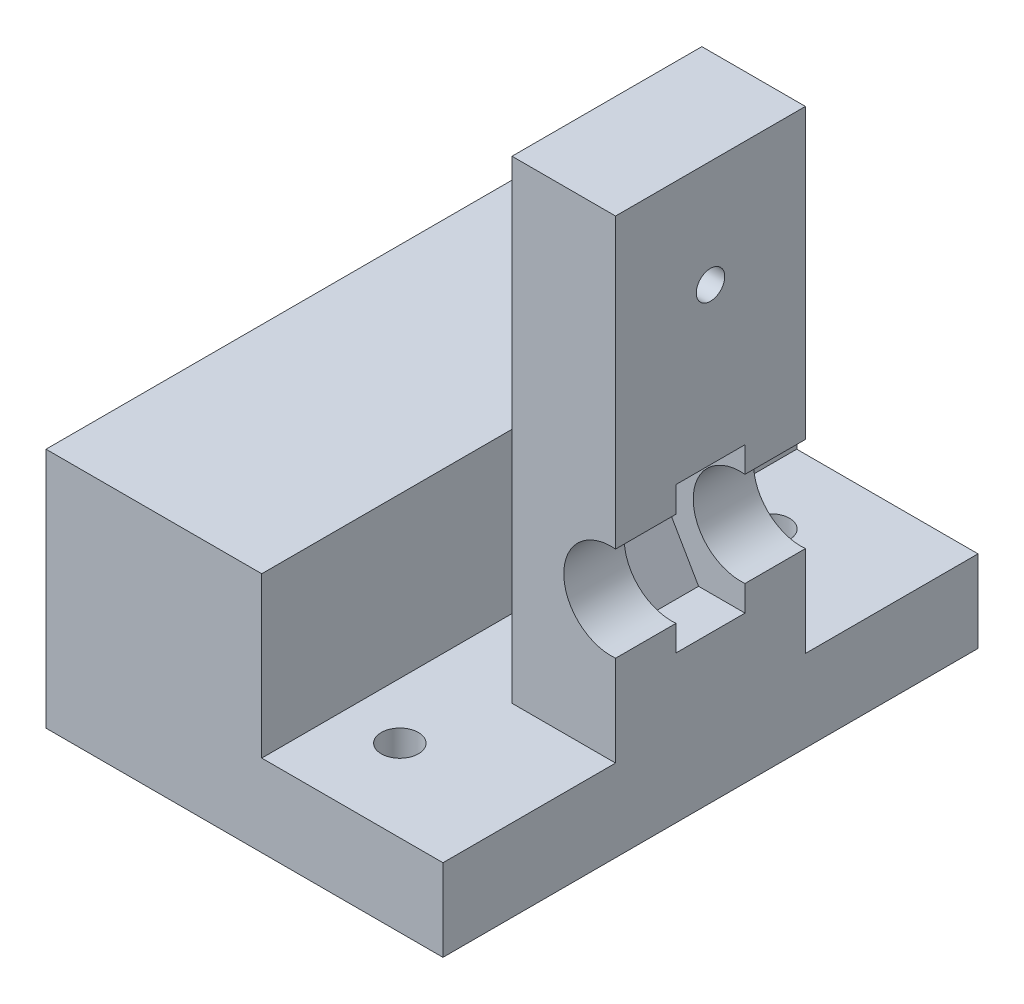
ISO-10303-21;
HEADER;
FILE_DESCRIPTION(('STEP AP214'),'2;1');
FILE_NAME('part.step','',(''),(''),'','','');
FILE_SCHEMA(('AUTOMOTIVE_DESIGN { 1 0 10303 214 1 1 1 1 }'));
ENDSEC;
DATA;
#1=APPLICATION_CONTEXT('core data for automotive mechanical design processes');
#2=APPLICATION_PROTOCOL_DEFINITION('international standard','automotive_design',2000,#1);
#3=PRODUCT_CONTEXT('',#1,'mechanical');
#4=PRODUCT('Part','Part','',(#3));
#5=PRODUCT_RELATED_PRODUCT_CATEGORY('part','',(#4));
#6=PRODUCT_DEFINITION_FORMATION('','',#4);
#7=PRODUCT_DEFINITION_CONTEXT('part definition',#1,'design');
#8=PRODUCT_DEFINITION('design','',#6,#7);
#9=PRODUCT_DEFINITION_SHAPE('','',#8);
#10=(LENGTH_UNIT() NAMED_UNIT(*) SI_UNIT(.MILLI.,.METRE.));
#11=(NAMED_UNIT(*) PLANE_ANGLE_UNIT() SI_UNIT($,.RADIAN.));
#12=(NAMED_UNIT(*) SI_UNIT($,.STERADIAN.) SOLID_ANGLE_UNIT());
#13=UNCERTAINTY_MEASURE_WITH_UNIT(LENGTH_MEASURE(1.E-05),#10,'distance_accuracy_value','');
#14=(GEOMETRIC_REPRESENTATION_CONTEXT(3) GLOBAL_UNCERTAINTY_ASSIGNED_CONTEXT((#13)) GLOBAL_UNIT_ASSIGNED_CONTEXT((#10,
#11,#12)) REPRESENTATION_CONTEXT('',''));
#15=CARTESIAN_POINT('',(0.,0.,0.));
#16=DIRECTION('',(0.,0.,1.));
#17=DIRECTION('',(1.,0.,0.));
#18=AXIS2_PLACEMENT_3D('',#15,#16,#17);
#19=CARTESIAN_POINT('',(0.,-50.2793146590531,0.));
#20=DIRECTION('',(0.,1.,0.));
#21=DIRECTION('',(0.,0.,1.));
#22=AXIS2_PLACEMENT_3D('',#19,#20,#21);
#23=PLANE('',#22);
#24=CARTESIAN_POINT('',(-14.3674698795181,-50.2793146590531,-17.5));
#25=DIRECTION('',(0.,1.,0.));
#26=DIRECTION('',(0.,0.,1.));
#27=AXIS2_PLACEMENT_3D('',#24,#25,#26);
#28=CIRCLE('',#27,2.15);
#29=CARTESIAN_POINT('',(-14.3674698795181,-50.2793146590531,-15.35));
#30=VERTEX_POINT('',#29);
#31=EDGE_CURVE('E232',#30,#30,#28,.T.);
#32=ORIENTED_EDGE('',*,*,#31,.F.);
#33=EDGE_LOOP('',(#32));
#34=FACE_BOUND('',#33,.T.);
#35=CARTESIAN_POINT('',(-14.3674698795181,-50.2793146590531,25.5));
#36=DIRECTION('',(0.,1.,0.));
#37=DIRECTION('',(0.,0.,1.));
#38=AXIS2_PLACEMENT_3D('',#35,#36,#37);
#39=CIRCLE('',#38,2.15);
#40=CARTESIAN_POINT('',(-14.3674698795181,-50.2793146590531,27.65));
#41=VERTEX_POINT('',#40);
#42=EDGE_CURVE('E219',#41,#41,#39,.T.);
#43=ORIENTED_EDGE('',*,*,#42,.F.);
#44=EDGE_LOOP('',(#43));
#45=FACE_BOUND('',#44,.T.);
#46=DIRECTION('',(1.,0.,0.));
#47=VECTOR('',#46,1.);
#48=CARTESIAN_POINT('',(0.132530120481926,-50.2793146590531,-27.));
#49=LINE('',#48,#47);
#50=CARTESIAN_POINT('',(-20.8674698795181,-50.2793146590531,-27.));
#51=VERTEX_POINT('',#50);
#52=CARTESIAN_POINT('',(0.132530120481926,-50.2793146590531,-27.));
#53=VERTEX_POINT('',#52);
#54=EDGE_CURVE('E246',#51,#53,#49,.T.);
#55=ORIENTED_EDGE('',*,*,#54,.F.);
#56=DIRECTION('',(0.,0.,-1.));
#57=VECTOR('',#56,1.);
#58=CARTESIAN_POINT('',(-20.8674698795181,-50.2793146590531,-27.));
#59=LINE('',#58,#57);
#60=CARTESIAN_POINT('',(-20.8674698795181,-50.2793146590531,35.));
#61=VERTEX_POINT('',#60);
#62=EDGE_CURVE('E207',#61,#51,#59,.T.);
#63=ORIENTED_EDGE('',*,*,#62,.F.);
#64=DIRECTION('',(-1.,0.,0.));
#65=VECTOR('',#64,1.);
#66=CARTESIAN_POINT('',(0.132530120481924,-50.2793146590531,35.));
#67=LINE('',#66,#65);
#68=CARTESIAN_POINT('',(0.132530120481924,-50.2793146590531,35.));
#69=VERTEX_POINT('',#68);
#70=EDGE_CURVE('E243',#69,#61,#67,.T.);
#71=ORIENTED_EDGE('',*,*,#70,.F.);
#72=DIRECTION('',(0.,0.,1.));
#73=VECTOR('',#72,1.);
#74=CARTESIAN_POINT('',(0.132530120481924,-50.2793146590531,15.));
#75=LINE('',#74,#73);
#76=CARTESIAN_POINT('',(0.132530120481924,-50.2793146590531,15.));
#77=VERTEX_POINT('',#76);
#78=EDGE_CURVE('E244',#77,#69,#75,.T.);
#79=ORIENTED_EDGE('',*,*,#78,.F.);
#80=DIRECTION('',(-1.,0.,0.));
#81=VECTOR('',#80,1.);
#82=CARTESIAN_POINT('',(0.,-50.2793146590531,15.));
#83=LINE('',#82,#81);
#84=CARTESIAN_POINT('',(-11.8674698795181,-50.2793146590531,15.));
#85=VERTEX_POINT('',#84);
#86=EDGE_CURVE('E264',#77,#85,#83,.T.);
#87=ORIENTED_EDGE('',*,*,#86,.T.);
#88=DIRECTION('',(0.,0.,1.));
#89=VECTOR('',#88,1.);
#90=CARTESIAN_POINT('',(-11.8674698795181,-50.2793146590531,8.));
#91=LINE('',#90,#89);
#92=CARTESIAN_POINT('',(-11.8674698795181,-50.2793146590531,-7.));
#93=VERTEX_POINT('',#92);
#94=EDGE_CURVE('E256',#93,#85,#91,.T.);
#95=ORIENTED_EDGE('',*,*,#94,.F.);
#96=DIRECTION('',(1.,0.,0.));
#97=VECTOR('',#96,1.);
#98=CARTESIAN_POINT('',(0.,-50.2793146590531,-7.));
#99=LINE('',#98,#97);
#100=CARTESIAN_POINT('',(0.132530120481924,-50.2793146590531,-7.));
#101=VERTEX_POINT('',#100);
#102=EDGE_CURVE('E262',#93,#101,#99,.T.);
#103=ORIENTED_EDGE('',*,*,#102,.T.);
#104=EDGE_CURVE('E240',#53,#101,#75,.T.);
#105=ORIENTED_EDGE('',*,*,#104,.F.);
#106=EDGE_LOOP('',(#55,#63,#71,#79,#87,#95,#103,#105));
#107=FACE_BOUND('',#106,.T.);
#108=ADVANCED_FACE('F49',(#34,#45,#107),#23,.T.);
#109=CARTESIAN_POINT('',(-11.8674698795181,-59.7793146590531,8.));
#110=DIRECTION('',(0.,1.,0.));
#111=DIRECTION('',(0.,0.,1.));
#112=AXIS2_PLACEMENT_3D('',#109,#110,#111);
#113=PLANE('',#112);
#114=CARTESIAN_POINT('',(-34.0674698795181,-59.7793146590531,23.2));
#115=DIRECTION('',(0.,-1.,0.));
#116=DIRECTION('',(0.,0.,-1.));
#117=AXIS2_PLACEMENT_3D('',#114,#115,#116);
#118=CIRCLE('',#117,4.75);
#119=CARTESIAN_POINT('',(-34.0674698795181,-59.7793146590531,18.45));
#120=VERTEX_POINT('',#119);
#121=EDGE_CURVE('E220',#120,#120,#118,.T.);
#122=ORIENTED_EDGE('',*,*,#121,.F.);
#123=EDGE_LOOP('',(#122));
#124=FACE_BOUND('',#123,.T.);
#125=CARTESIAN_POINT('',(-34.0674698795181,-59.7793146590531,-15.2));
#126=DIRECTION('',(0.,-1.,0.));
#127=DIRECTION('',(0.,0.,-1.));
#128=AXIS2_PLACEMENT_3D('',#125,#126,#127);
#129=CIRCLE('',#128,4.75);
#130=CARTESIAN_POINT('',(-34.0674698795181,-59.7793146590531,-19.95));
#131=VERTEX_POINT('',#130);
#132=EDGE_CURVE('E215',#131,#131,#129,.T.);
#133=ORIENTED_EDGE('',*,*,#132,.F.);
#134=EDGE_LOOP('',(#133));
#135=FACE_BOUND('',#134,.T.);
#136=CARTESIAN_POINT('',(-14.3674698795181,-59.7793146590531,-17.5));
#137=DIRECTION('',(0.,1.,0.));
#138=DIRECTION('',(0.,0.,1.));
#139=AXIS2_PLACEMENT_3D('',#136,#137,#138);
#140=CIRCLE('',#139,2.15);
#141=CARTESIAN_POINT('',(-14.3674698795181,-59.7793146590531,-15.35));
#142=VERTEX_POINT('',#141);
#143=EDGE_CURVE('E228',#142,#142,#140,.T.);
#144=ORIENTED_EDGE('',*,*,#143,.T.);
#145=EDGE_LOOP('',(#144));
#146=FACE_BOUND('',#145,.T.);
#147=CARTESIAN_POINT('',(-14.3674698795181,-59.7793146590531,25.5));
#148=DIRECTION('',(0.,1.,0.));
#149=DIRECTION('',(0.,0.,1.));
#150=AXIS2_PLACEMENT_3D('',#147,#148,#149);
#151=CIRCLE('',#150,2.15);
#152=CARTESIAN_POINT('',(-14.3674698795181,-59.7793146590531,27.65));
#153=VERTEX_POINT('',#152);
#154=EDGE_CURVE('E235',#153,#153,#151,.T.);
#155=ORIENTED_EDGE('',*,*,#154,.T.);
#156=EDGE_LOOP('',(#155));
#157=FACE_BOUND('',#156,.T.);
#158=DIRECTION('',(0.,0.,-1.));
#159=VECTOR('',#158,1.);
#160=CARTESIAN_POINT('',(0.132530120481924,-59.7793146590531,15.));
#161=LINE('',#160,#159);
#162=CARTESIAN_POINT('',(0.132530120481924,-59.7793146590531,35.));
#163=VERTEX_POINT('',#162);
#164=CARTESIAN_POINT('',(0.132530120481926,-59.7793146590531,-27.));
#165=VERTEX_POINT('',#164);
#166=EDGE_CURVE('E269',#163,#165,#161,.T.);
#167=ORIENTED_EDGE('',*,*,#166,.F.);
#168=DIRECTION('',(-1.,0.,0.));
#169=VECTOR('',#168,1.);
#170=CARTESIAN_POINT('',(0.132530120481924,-59.7793146590531,35.));
#171=LINE('',#170,#169);
#172=CARTESIAN_POINT('',(-45.8674698795181,-59.7793146590531,35.));
#173=VERTEX_POINT('',#172);
#174=EDGE_CURVE('E231',#163,#173,#171,.T.);
#175=ORIENTED_EDGE('',*,*,#174,.T.);
#176=DIRECTION('',(0.,0.,-1.));
#177=VECTOR('',#176,1.);
#178=CARTESIAN_POINT('',(-45.8674698795181,-59.7793146590531,-27.));
#179=LINE('',#178,#177);
#180=CARTESIAN_POINT('',(-45.8674698795181,-59.7793146590531,-27.));
#181=VERTEX_POINT('',#180);
#182=EDGE_CURVE('E188',#173,#181,#179,.T.);
#183=ORIENTED_EDGE('',*,*,#182,.T.);
#184=DIRECTION('',(1.,0.,0.));
#185=VECTOR('',#184,1.);
#186=CARTESIAN_POINT('',(0.132530120481926,-59.7793146590531,-27.));
#187=LINE('',#186,#185);
#188=EDGE_CURVE('E250',#181,#165,#187,.T.);
#189=ORIENTED_EDGE('',*,*,#188,.T.);
#190=EDGE_LOOP('',(#167,#175,#183,#189));
#191=FACE_BOUND('',#190,.T.);
#192=ADVANCED_FACE('F417',(#124,#135,#146,#157,#191),#113,.F.);
#193=CARTESIAN_POINT('',(-11.8674698795181,4.62068534094692,8.));
#194=DIRECTION('',(0.,-1.,0.));
#195=DIRECTION('',(1.,0.,0.));
#196=AXIS2_PLACEMENT_3D('',#193,#194,#195);
#197=PLANE('',#196);
#198=DIRECTION('',(0.,0.,1.));
#199=VECTOR('',#198,1.);
#200=CARTESIAN_POINT('',(0.132530120481913,4.62068534094692,15.));
#201=LINE('',#200,#199);
#202=CARTESIAN_POINT('',(0.132530120481913,4.62068534094692,-7.));
#203=VERTEX_POINT('',#202);
#204=CARTESIAN_POINT('',(0.132530120481913,4.62068534094692,15.));
#205=VERTEX_POINT('',#204);
#206=EDGE_CURVE('E274',#203,#205,#201,.T.);
#207=ORIENTED_EDGE('',*,*,#206,.F.);
#208=DIRECTION('',(1.,0.,0.));
#209=VECTOR('',#208,1.);
#210=CARTESIAN_POINT('',(11.1325301204819,4.62068534094692,-7.));
#211=LINE('',#210,#209);
#212=CARTESIAN_POINT('',(-11.8674698795181,4.62068534094692,-7.));
#213=VERTEX_POINT('',#212);
#214=EDGE_CURVE('E309',#213,#203,#211,.T.);
#215=ORIENTED_EDGE('',*,*,#214,.F.);
#216=DIRECTION('',(0.,0.,-1.));
#217=VECTOR('',#216,1.);
#218=CARTESIAN_POINT('',(-11.8674698795181,4.62068534094692,8.));
#219=LINE('',#218,#217);
#220=CARTESIAN_POINT('',(-11.8674698795181,4.62068534094692,15.));
#221=VERTEX_POINT('',#220);
#222=EDGE_CURVE('E13',#221,#213,#219,.T.);
#223=ORIENTED_EDGE('',*,*,#222,.F.);
#224=DIRECTION('',(-1.,0.,0.));
#225=VECTOR('',#224,1.);
#226=CARTESIAN_POINT('',(-11.8674698795181,4.62068534094692,15.));
#227=LINE('',#226,#225);
#228=EDGE_CURVE('E321',#205,#221,#227,.T.);
#229=ORIENTED_EDGE('',*,*,#228,.F.);
#230=EDGE_LOOP('',(#207,#215,#223,#229));
#231=FACE_BOUND('',#230,.T.);
#232=ADVANCED_FACE('F379',(#231),#197,.F.);
#233=CARTESIAN_POINT('',(4.51113989513426,-25.8293146590531,8.));
#234=DIRECTION('',(0.,-1.,0.));
#235=DIRECTION('',(0.,0.,-1.));
#236=AXIS2_PLACEMENT_3D('',#233,#234,#235);
#237=PLANE('',#236);
#238=DIRECTION('',(-1.,0.,0.));
#239=VECTOR('',#238,1.);
#240=CARTESIAN_POINT('',(4.51113989513426,-25.8293146590531,0.));
#241=LINE('',#240,#239);
#242=CARTESIAN_POINT('',(0.132530120481917,-25.8293146590531,0.));
#243=VERTEX_POINT('',#242);
#244=CARTESIAN_POINT('',(-5.24607965417042,-25.8293146590531,0.));
#245=VERTEX_POINT('',#244);
#246=EDGE_CURVE('E323',#243,#245,#241,.T.);
#247=ORIENTED_EDGE('',*,*,#246,.F.);
#248=DIRECTION('',(0.,0.,1.));
#249=VECTOR('',#248,1.);
#250=CARTESIAN_POINT('',(0.132530120481917,-25.8293146590531,8.));
#251=LINE('',#250,#249);
#252=CARTESIAN_POINT('',(0.132530120481917,-25.8293146590531,8.));
#253=VERTEX_POINT('',#252);
#254=EDGE_CURVE('E292',#243,#253,#251,.T.);
#255=ORIENTED_EDGE('',*,*,#254,.T.);
#256=DIRECTION('',(-1.,0.,0.));
#257=VECTOR('',#256,1.);
#258=CARTESIAN_POINT('',(4.51113989513426,-25.8293146590531,8.));
#259=LINE('',#258,#257);
#260=CARTESIAN_POINT('',(-5.24607965417042,-25.8293146590531,8.));
#261=VERTEX_POINT('',#260);
#262=EDGE_CURVE('E324',#253,#261,#259,.T.);
#263=ORIENTED_EDGE('',*,*,#262,.T.);
#264=DIRECTION('',(0.,0.,-1.));
#265=VECTOR('',#264,1.);
#266=CARTESIAN_POINT('',(-5.24607965417042,-25.8293146590531,8.));
#267=LINE('',#266,#265);
#268=EDGE_CURVE('E58',#261,#245,#267,.T.);
#269=ORIENTED_EDGE('',*,*,#268,.T.);
#270=EDGE_LOOP('',(#247,#255,#263,#269));
#271=FACE_BOUND('',#270,.T.);
#272=ADVANCED_FACE('F354',(#271),#237,.T.);
#273=CARTESIAN_POINT('',(-5.24607965417041,-42.7293146590531,8.));
#274=DIRECTION('',(0.,1.,0.));
#275=DIRECTION('',(0.,0.,1.));
#276=AXIS2_PLACEMENT_3D('',#273,#274,#275);
#277=PLANE('',#276);
#278=DIRECTION('',(1.,0.,0.));
#279=VECTOR('',#278,1.);
#280=CARTESIAN_POINT('',(-5.24607965417041,-42.7293146590531,8.));
#281=LINE('',#280,#279);
#282=CARTESIAN_POINT('',(-5.24607965417041,-42.7293146590531,8.));
#283=VERTEX_POINT('',#282);
#284=CARTESIAN_POINT('',(0.13253012048192,-42.7293146590531,8.));
#285=VERTEX_POINT('',#284);
#286=EDGE_CURVE('E333',#283,#285,#281,.T.);
#287=ORIENTED_EDGE('',*,*,#286,.T.);
#288=DIRECTION('',(0.,0.,-1.));
#289=VECTOR('',#288,1.);
#290=CARTESIAN_POINT('',(0.13253012048192,-42.7293146590531,8.));
#291=LINE('',#290,#289);
#292=CARTESIAN_POINT('',(0.13253012048192,-42.7293146590531,0.));
#293=VERTEX_POINT('',#292);
#294=EDGE_CURVE('E281',#285,#293,#291,.T.);
#295=ORIENTED_EDGE('',*,*,#294,.T.);
#296=DIRECTION('',(1.,0.,0.));
#297=VECTOR('',#296,1.);
#298=CARTESIAN_POINT('',(-5.24607965417041,-42.7293146590531,0.));
#299=LINE('',#298,#297);
#300=CARTESIAN_POINT('',(-5.24607965417041,-42.7293146590531,0.));
#301=VERTEX_POINT('',#300);
#302=EDGE_CURVE('E327',#301,#293,#299,.T.);
#303=ORIENTED_EDGE('',*,*,#302,.F.);
#304=DIRECTION('',(0.,0.,-1.));
#305=VECTOR('',#304,1.);
#306=CARTESIAN_POINT('',(-5.24607965417041,-42.7293146590531,8.));
#307=LINE('',#306,#305);
#308=EDGE_CURVE('E336',#283,#301,#307,.T.);
#309=ORIENTED_EDGE('',*,*,#308,.F.);
#310=EDGE_LOOP('',(#287,#295,#303,#309));
#311=FACE_BOUND('',#310,.T.);
#312=ADVANCED_FACE('F401',(#311),#277,.T.);
#313=CARTESIAN_POINT('',(0.,0.,15.));
#314=DIRECTION('',(0.,0.,1.));
#315=DIRECTION('',(1.,0.,0.));
#316=AXIS2_PLACEMENT_3D('',#313,#314,#315);
#317=PLANE('',#316);
#318=ORIENTED_EDGE('',*,*,#86,.F.);
#319=DIRECTION('',(0.,-1.,0.));
#320=VECTOR('',#319,1.);
#321=CARTESIAN_POINT('',(0.132530120481913,4.62068534094692,15.));
#322=LINE('',#321,#320);
#323=CARTESIAN_POINT('',(0.13253012048192,-39.7565402341047,15.));
#324=VERTEX_POINT('',#323);
#325=EDGE_CURVE('E266',#324,#77,#322,.T.);
#326=ORIENTED_EDGE('',*,*,#325,.F.);
#327=CARTESIAN_POINT('',(-0.367469879518079,-34.2793146590531,15.));
#328=DIRECTION('',(0.,0.,1.));
#329=DIRECTION('',(1.,0.,0.));
#330=AXIS2_PLACEMENT_3D('',#327,#328,#329);
#331=CIRCLE('',#330,5.5);
#332=CARTESIAN_POINT('',(0.132530120481919,-28.8020890840014,15.));
#333=VERTEX_POINT('',#332);
#334=EDGE_CURVE('E313',#333,#324,#331,.T.);
#335=ORIENTED_EDGE('',*,*,#334,.F.);
#336=EDGE_CURVE('E267',#205,#333,#322,.T.);
#337=ORIENTED_EDGE('',*,*,#336,.F.);
#338=ORIENTED_EDGE('',*,*,#228,.T.);
#339=DIRECTION('',(0.,-1.,0.));
#340=VECTOR('',#339,1.);
#341=CARTESIAN_POINT('',(-11.8674698795181,4.62068534094692,15.));
#342=LINE('',#341,#340);
#343=EDGE_CURVE('E316',#221,#85,#342,.T.);
#344=ORIENTED_EDGE('',*,*,#343,.T.);
#345=EDGE_LOOP('',(#318,#326,#335,#337,#338,#344));
#346=FACE_BOUND('',#345,.T.);
#347=ADVANCED_FACE('F386',(#346),#317,.T.);
#348=CARTESIAN_POINT('',(0.,0.,8.));
#349=DIRECTION('',(0.,0.,1.));
#350=DIRECTION('',(1.,0.,0.));
#351=AXIS2_PLACEMENT_3D('',#348,#349,#350);
#352=PLANE('',#351);
#353=DIRECTION('',(0.,1.,0.));
#354=VECTOR('',#353,1.);
#355=CARTESIAN_POINT('',(0.132530120481913,0.,8.));
#356=LINE('',#355,#354);
#357=CARTESIAN_POINT('',(0.13253012048192,-39.7565402341047,8.));
#358=VERTEX_POINT('',#357);
#359=EDGE_CURVE('E284',#285,#358,#356,.T.);
#360=ORIENTED_EDGE('',*,*,#359,.F.);
#361=ORIENTED_EDGE('',*,*,#286,.F.);
#362=DIRECTION('',(0.5,-0.866025403784438,0.));
#363=VECTOR('',#362,1.);
#364=CARTESIAN_POINT('',(-10.1246894288228,-34.2793146590531,8.));
#365=LINE('',#364,#363);
#366=CARTESIAN_POINT('',(-10.1246894288228,-34.2793146590531,8.));
#367=VERTEX_POINT('',#366);
#368=EDGE_CURVE('E330',#367,#283,#365,.T.);
#369=ORIENTED_EDGE('',*,*,#368,.F.);
#370=DIRECTION('',(-0.5,-0.866025403784439,0.));
#371=VECTOR('',#370,1.);
#372=CARTESIAN_POINT('',(-5.24607965417042,-25.8293146590531,8.));
#373=LINE('',#372,#371);
#374=EDGE_CURVE('E326',#261,#367,#373,.T.);
#375=ORIENTED_EDGE('',*,*,#374,.F.);
#376=ORIENTED_EDGE('',*,*,#262,.F.);
#377=CARTESIAN_POINT('',(0.132530120481918,-28.8020890840014,8.));
#378=VERTEX_POINT('',#377);
#379=EDGE_CURVE('E287',#378,#253,#356,.T.);
#380=ORIENTED_EDGE('',*,*,#379,.F.);
#381=CARTESIAN_POINT('',(-0.367469879518079,-34.2793146590531,8.));
#382=DIRECTION('',(0.,0.,1.));
#383=DIRECTION('',(1.,0.,0.));
#384=AXIS2_PLACEMENT_3D('',#381,#382,#383);
#385=CIRCLE('',#384,5.5);
#386=EDGE_CURVE('E312',#378,#358,#385,.T.);
#387=ORIENTED_EDGE('',*,*,#386,.T.);
#388=EDGE_LOOP('',(#360,#361,#369,#375,#376,#380,#387));
#389=FACE_BOUND('',#388,.T.);
#390=ADVANCED_FACE('F395',(#389),#352,.F.);
#391=CARTESIAN_POINT('',(-0.367469879518079,-34.2793146590531,15.));
#392=DIRECTION('',(0.,0.,-1.));
#393=DIRECTION('',(-1.,0.,0.));
#394=AXIS2_PLACEMENT_3D('',#391,#392,#393);
#395=CYLINDRICAL_SURFACE('',#394,5.5);
#396=ORIENTED_EDGE('',*,*,#334,.T.);
#397=DIRECTION('',(0.,0.,-1.));
#398=VECTOR('',#397,1.);
#399=CARTESIAN_POINT('',(0.13253012048192,-39.7565402341047,15.));
#400=LINE('',#399,#398);
#401=EDGE_CURVE('E286',#324,#358,#400,.T.);
#402=ORIENTED_EDGE('',*,*,#401,.T.);
#403=ORIENTED_EDGE('',*,*,#386,.F.);
#404=DIRECTION('',(0.,0.,-1.));
#405=VECTOR('',#404,1.);
#406=CARTESIAN_POINT('',(0.132530120481918,-28.8020890840014,15.));
#407=LINE('',#406,#405);
#408=EDGE_CURVE('E295',#378,#333,#407,.F.);
#409=ORIENTED_EDGE('',*,*,#408,.T.);
#410=EDGE_LOOP('',(#396,#402,#403,#409));
#411=FACE_BOUND('',#410,.T.);
#412=ADVANCED_FACE('F390',(#411),#395,.F.);
#413=CARTESIAN_POINT('',(0.,0.,0.));
#414=DIRECTION('',(0.,0.,-1.));
#415=DIRECTION('',(-1.,0.,0.));
#416=AXIS2_PLACEMENT_3D('',#413,#414,#415);
#417=PLANE('',#416);
#418=DIRECTION('',(0.,-1.,0.));
#419=VECTOR('',#418,1.);
#420=CARTESIAN_POINT('',(0.132530120481913,0.,0.));
#421=LINE('',#420,#419);
#422=CARTESIAN_POINT('',(0.132530120481918,-28.8020890840014,0.));
#423=VERTEX_POINT('',#422);
#424=EDGE_CURVE('E73',#243,#423,#421,.T.);
#425=ORIENTED_EDGE('',*,*,#424,.F.);
#426=ORIENTED_EDGE('',*,*,#246,.T.);
#427=DIRECTION('',(-0.5,-0.866025403784439,0.));
#428=VECTOR('',#427,1.);
#429=CARTESIAN_POINT('',(-5.24607965417042,-25.8293146590531,0.));
#430=LINE('',#429,#428);
#431=CARTESIAN_POINT('',(-10.1246894288228,-34.2793146590531,0.));
#432=VERTEX_POINT('',#431);
#433=EDGE_CURVE('E338',#245,#432,#430,.T.);
#434=ORIENTED_EDGE('',*,*,#433,.T.);
#435=DIRECTION('',(0.5,-0.866025403784438,0.));
#436=VECTOR('',#435,1.);
#437=CARTESIAN_POINT('',(-10.1246894288228,-34.2793146590531,0.));
#438=LINE('',#437,#436);
#439=EDGE_CURVE('E341',#432,#301,#438,.T.);
#440=ORIENTED_EDGE('',*,*,#439,.T.);
#441=ORIENTED_EDGE('',*,*,#302,.T.);
#442=CARTESIAN_POINT('',(0.13253012048192,-39.7565402341047,0.));
#443=VERTEX_POINT('',#442);
#444=EDGE_CURVE('E279',#443,#293,#421,.T.);
#445=ORIENTED_EDGE('',*,*,#444,.F.);
#446=CARTESIAN_POINT('',(-0.367469879518079,-34.2793146590531,0.));
#447=DIRECTION('',(0.,0.,-1.));
#448=DIRECTION('',(-1.,0.,0.));
#449=AXIS2_PLACEMENT_3D('',#446,#447,#448);
#450=CIRCLE('',#449,5.5);
#451=EDGE_CURVE('E301',#443,#423,#450,.T.);
#452=ORIENTED_EDGE('',*,*,#451,.T.);
#453=EDGE_LOOP('',(#425,#426,#434,#440,#441,#445,#452));
#454=FACE_BOUND('',#453,.T.);
#455=ADVANCED_FACE('F362',(#454),#417,.F.);
#456=CARTESIAN_POINT('',(0.,0.,-7.));
#457=DIRECTION('',(0.,0.,-1.));
#458=DIRECTION('',(-1.,0.,0.));
#459=AXIS2_PLACEMENT_3D('',#456,#457,#458);
#460=PLANE('',#459);
#461=ORIENTED_EDGE('',*,*,#102,.F.);
#462=DIRECTION('',(0.,1.,0.));
#463=VECTOR('',#462,1.);
#464=CARTESIAN_POINT('',(-11.8674698795181,4.62068534094692,-7.));
#465=LINE('',#464,#463);
#466=EDGE_CURVE('E305',#93,#213,#465,.T.);
#467=ORIENTED_EDGE('',*,*,#466,.T.);
#468=ORIENTED_EDGE('',*,*,#214,.T.);
#469=DIRECTION('',(0.,1.,0.));
#470=VECTOR('',#469,1.);
#471=CARTESIAN_POINT('',(0.132530120481913,4.62068534094692,-7.));
#472=LINE('',#471,#470);
#473=CARTESIAN_POINT('',(0.132530120481919,-28.8020890840014,-7.));
#474=VERTEX_POINT('',#473);
#475=EDGE_CURVE('E271',#474,#203,#472,.T.);
#476=ORIENTED_EDGE('',*,*,#475,.F.);
#477=CARTESIAN_POINT('',(-0.367469879518079,-34.2793146590531,-7.));
#478=DIRECTION('',(0.,0.,-1.));
#479=DIRECTION('',(-1.,0.,0.));
#480=AXIS2_PLACEMENT_3D('',#477,#478,#479);
#481=CIRCLE('',#480,5.5);
#482=CARTESIAN_POINT('',(0.13253012048192,-39.7565402341047,-7.));
#483=VERTEX_POINT('',#482);
#484=EDGE_CURVE('E302',#483,#474,#481,.T.);
#485=ORIENTED_EDGE('',*,*,#484,.F.);
#486=EDGE_CURVE('E272',#101,#483,#472,.T.);
#487=ORIENTED_EDGE('',*,*,#486,.F.);
#488=EDGE_LOOP('',(#461,#467,#468,#476,#485,#487));
#489=FACE_BOUND('',#488,.T.);
#490=ADVANCED_FACE('F373',(#489),#460,.T.);
#491=CARTESIAN_POINT('',(-0.367469879518079,-34.2793146590531,-7.));
#492=DIRECTION('',(0.,0.,1.));
#493=DIRECTION('',(1.,0.,0.));
#494=AXIS2_PLACEMENT_3D('',#491,#492,#493);
#495=CYLINDRICAL_SURFACE('',#494,5.5);
#496=ORIENTED_EDGE('',*,*,#484,.T.);
#497=DIRECTION('',(0.,0.,1.));
#498=VECTOR('',#497,1.);
#499=CARTESIAN_POINT('',(0.132530120481918,-28.8020890840014,-7.));
#500=LINE('',#499,#498);
#501=EDGE_CURVE('E290',#474,#423,#500,.T.);
#502=ORIENTED_EDGE('',*,*,#501,.T.);
#503=ORIENTED_EDGE('',*,*,#451,.F.);
#504=DIRECTION('',(0.,0.,1.));
#505=VECTOR('',#504,1.);
#506=CARTESIAN_POINT('',(0.13253012048192,-39.7565402341047,-7.));
#507=LINE('',#506,#505);
#508=EDGE_CURVE('E276',#443,#483,#507,.F.);
#509=ORIENTED_EDGE('',*,*,#508,.T.);
#510=EDGE_LOOP('',(#496,#502,#503,#509));
#511=FACE_BOUND('',#510,.T.);
#512=ADVANCED_FACE('F366',(#511),#495,.F.);
#513=CARTESIAN_POINT('',(-11.8674698795181,-7.77931465905308,4.));
#514=DIRECTION('',(1.,0.,0.));
#515=DIRECTION('',(0.,1.,0.));
#516=AXIS2_PLACEMENT_3D('',#513,#514,#515);
#517=CYLINDRICAL_SURFACE('',#516,1.65);
#518=CARTESIAN_POINT('',(-11.8674698795181,-7.77931465905308,4.));
#519=DIRECTION('',(1.,0.,0.));
#520=DIRECTION('',(0.,1.,0.));
#521=AXIS2_PLACEMENT_3D('',#518,#519,#520);
#522=CIRCLE('',#521,1.65);
#523=CARTESIAN_POINT('',(-11.8674698795181,-6.12931465905308,4.));
#524=VERTEX_POINT('',#523);
#525=EDGE_CURVE('E298',#524,#524,#522,.T.);
#526=ORIENTED_EDGE('',*,*,#525,.F.);
#527=EDGE_LOOP('',(#526));
#528=FACE_BOUND('',#527,.T.);
#529=CARTESIAN_POINT('',(0.132530120481915,-7.77931465905308,4.));
#530=DIRECTION('',(1.,0.,0.));
#531=DIRECTION('',(0.,1.,0.));
#532=AXIS2_PLACEMENT_3D('',#529,#530,#531);
#533=CIRCLE('',#532,1.65);
#534=CARTESIAN_POINT('',(0.132530120481915,-6.12931465905308,4.));
#535=VERTEX_POINT('',#534);
#536=EDGE_CURVE('E53',#535,#535,#533,.F.);
#537=ORIENTED_EDGE('',*,*,#536,.F.);
#538=EDGE_LOOP('',(#537));
#539=FACE_BOUND('',#538,.T.);
#540=ADVANCED_FACE('F450',(#528,#539),#517,.F.);
#541=CARTESIAN_POINT('',(-11.8674698795181,4.62068534094692,8.));
#542=DIRECTION('',(1.,0.,0.));
#543=DIRECTION('',(0.,1.,0.));
#544=AXIS2_PLACEMENT_3D('',#541,#542,#543);
#545=PLANE('',#544);
#546=ORIENTED_EDGE('',*,*,#525,.T.);
#547=EDGE_LOOP('',(#546));
#548=FACE_BOUND('',#547,.T.);
#549=ORIENTED_EDGE('',*,*,#466,.F.);
#550=ORIENTED_EDGE('',*,*,#94,.T.);
#551=ORIENTED_EDGE('',*,*,#343,.F.);
#552=ORIENTED_EDGE('',*,*,#222,.T.);
#553=EDGE_LOOP('',(#549,#550,#551,#552));
#554=FACE_BOUND('',#553,.T.);
#555=ADVANCED_FACE('F51',(#548,#554),#545,.F.);
#556=CARTESIAN_POINT('',(-5.24607965417042,-25.8293146590531,8.));
#557=DIRECTION('',(0.866025403784439,-0.5,0.));
#558=DIRECTION('',(0.5,0.866025403784439,0.));
#559=AXIS2_PLACEMENT_3D('',#556,#557,#558);
#560=PLANE('',#559);
#561=ORIENTED_EDGE('',*,*,#433,.F.);
#562=ORIENTED_EDGE('',*,*,#268,.F.);
#563=ORIENTED_EDGE('',*,*,#374,.T.);
#564=DIRECTION('',(0.,0.,-1.));
#565=VECTOR('',#564,1.);
#566=CARTESIAN_POINT('',(-10.1246894288228,-34.2793146590531,8.));
#567=LINE('',#566,#565);
#568=EDGE_CURVE('E347',#367,#432,#567,.T.);
#569=ORIENTED_EDGE('',*,*,#568,.T.);
#570=EDGE_LOOP('',(#561,#562,#563,#569));
#571=FACE_BOUND('',#570,.T.);
#572=ADVANCED_FACE('F358',(#571),#560,.T.);
#573=CARTESIAN_POINT('',(-10.1246894288228,-34.2793146590531,8.));
#574=DIRECTION('',(0.866025403784439,0.5,0.));
#575=DIRECTION('',(-0.5,0.866025403784439,0.));
#576=AXIS2_PLACEMENT_3D('',#573,#574,#575);
#577=PLANE('',#576);
#578=ORIENTED_EDGE('',*,*,#439,.F.);
#579=ORIENTED_EDGE('',*,*,#568,.F.);
#580=ORIENTED_EDGE('',*,*,#368,.T.);
#581=ORIENTED_EDGE('',*,*,#308,.T.);
#582=EDGE_LOOP('',(#578,#579,#580,#581));
#583=FACE_BOUND('',#582,.T.);
#584=ADVANCED_FACE('F397',(#583),#577,.T.);
#585=CARTESIAN_POINT('',(0.132530120481913,0.,0.));
#586=DIRECTION('',(1.,0.,0.));
#587=DIRECTION('',(0.,1.,0.));
#588=AXIS2_PLACEMENT_3D('',#585,#586,#587);
#589=PLANE('',#588);
#590=ORIENTED_EDGE('',*,*,#536,.T.);
#591=EDGE_LOOP('',(#590));
#592=FACE_BOUND('',#591,.T.);
#593=ORIENTED_EDGE('',*,*,#379,.T.);
#594=ORIENTED_EDGE('',*,*,#254,.F.);
#595=ORIENTED_EDGE('',*,*,#424,.T.);
#596=ORIENTED_EDGE('',*,*,#501,.F.);
#597=ORIENTED_EDGE('',*,*,#475,.T.);
#598=ORIENTED_EDGE('',*,*,#206,.T.);
#599=ORIENTED_EDGE('',*,*,#336,.T.);
#600=ORIENTED_EDGE('',*,*,#408,.F.);
#601=EDGE_LOOP('',(#593,#594,#595,#596,#597,#598,#599,#600));
#602=FACE_BOUND('',#601,.T.);
#603=ADVANCED_FACE('F369',(#592,#602),#589,.T.);
#604=ORIENTED_EDGE('',*,*,#325,.T.);
#605=ORIENTED_EDGE('',*,*,#78,.T.);
#606=DIRECTION('',(0.,-1.,0.));
#607=VECTOR('',#606,1.);
#608=CARTESIAN_POINT('',(0.132530120481924,-50.2793146590531,35.));
#609=LINE('',#608,#607);
#610=EDGE_CURVE('E193',#69,#163,#609,.T.);
#611=ORIENTED_EDGE('',*,*,#610,.T.);
#612=ORIENTED_EDGE('',*,*,#166,.T.);
#613=DIRECTION('',(0.,-1.,0.));
#614=VECTOR('',#613,1.);
#615=CARTESIAN_POINT('',(0.132530120481926,-50.2793146590531,-27.));
#616=LINE('',#615,#614);
#617=EDGE_CURVE('E253',#53,#165,#616,.T.);
#618=ORIENTED_EDGE('',*,*,#617,.F.);
#619=ORIENTED_EDGE('',*,*,#104,.T.);
#620=ORIENTED_EDGE('',*,*,#486,.T.);
#621=ORIENTED_EDGE('',*,*,#508,.F.);
#622=ORIENTED_EDGE('',*,*,#444,.T.);
#623=ORIENTED_EDGE('',*,*,#294,.F.);
#624=ORIENTED_EDGE('',*,*,#359,.T.);
#625=ORIENTED_EDGE('',*,*,#401,.F.);
#626=EDGE_LOOP('',(#604,#605,#611,#612,#618,#619,#620,#621,#622,#623,#624,#625));
#627=FACE_BOUND('',#626,.T.);
#628=ADVANCED_FACE('F403',(#627),#589,.T.);
#629=CARTESIAN_POINT('',(0.132530120481926,-50.2793146590531,-27.));
#630=DIRECTION('',(0.,0.,-1.));
#631=DIRECTION('',(-1.,0.,0.));
#632=AXIS2_PLACEMENT_3D('',#629,#630,#631);
#633=PLANE('',#632);
#634=ORIENTED_EDGE('',*,*,#188,.F.);
#635=DIRECTION('',(0.,-1.,0.));
#636=VECTOR('',#635,1.);
#637=CARTESIAN_POINT('',(-45.8674698795181,-50.2793146590531,-27.));
#638=LINE('',#637,#636);
#639=CARTESIAN_POINT('',(-45.8674698795181,-31.7793146590531,-27.));
#640=VERTEX_POINT('',#639);
#641=EDGE_CURVE('E192',#640,#181,#638,.T.);
#642=ORIENTED_EDGE('',*,*,#641,.F.);
#643=DIRECTION('',(-1.,0.,0.));
#644=VECTOR('',#643,1.);
#645=CARTESIAN_POINT('',(-45.8674698795181,-31.7793146590531,-27.));
#646=LINE('',#645,#644);
#647=CARTESIAN_POINT('',(-20.8674698795181,-31.7793146590531,-27.));
#648=VERTEX_POINT('',#647);
#649=EDGE_CURVE('E206',#648,#640,#646,.T.);
#650=ORIENTED_EDGE('',*,*,#649,.F.);
#651=DIRECTION('',(0.,-1.,0.));
#652=VECTOR('',#651,1.);
#653=CARTESIAN_POINT('',(-20.8674698795181,-31.7793146590531,-27.));
#654=LINE('',#653,#652);
#655=EDGE_CURVE('E65',#648,#51,#654,.T.);
#656=ORIENTED_EDGE('',*,*,#655,.T.);
#657=ORIENTED_EDGE('',*,*,#54,.T.);
#658=ORIENTED_EDGE('',*,*,#617,.T.);
#659=EDGE_LOOP('',(#634,#642,#650,#656,#657,#658));
#660=FACE_BOUND('',#659,.T.);
#661=ADVANCED_FACE('F415',(#660),#633,.T.);
#662=CARTESIAN_POINT('',(-45.8674698795181,-50.2793146590531,-27.));
#663=DIRECTION('',(-1.,0.,0.));
#664=DIRECTION('',(0.,0.,1.));
#665=AXIS2_PLACEMENT_3D('',#662,#663,#664);
#666=PLANE('',#665);
#667=ORIENTED_EDGE('',*,*,#182,.F.);
#668=DIRECTION('',(0.,-1.,0.));
#669=VECTOR('',#668,1.);
#670=CARTESIAN_POINT('',(-45.8674698795181,-50.2793146590531,35.));
#671=LINE('',#670,#669);
#672=CARTESIAN_POINT('',(-45.8674698795181,-31.7793146590531,35.));
#673=VERTEX_POINT('',#672);
#674=EDGE_CURVE('E182',#673,#173,#671,.T.);
#675=ORIENTED_EDGE('',*,*,#674,.F.);
#676=DIRECTION('',(0.,0.,1.));
#677=VECTOR('',#676,1.);
#678=CARTESIAN_POINT('',(-45.8674698795181,-31.7793146590531,-27.));
#679=LINE('',#678,#677);
#680=EDGE_CURVE('E186',#640,#673,#679,.T.);
#681=ORIENTED_EDGE('',*,*,#680,.F.);
#682=ORIENTED_EDGE('',*,*,#641,.T.);
#683=EDGE_LOOP('',(#667,#675,#681,#682));
#684=FACE_BOUND('',#683,.T.);
#685=ADVANCED_FACE('F184',(#684),#666,.T.);
#686=CARTESIAN_POINT('',(0.132530120481924,-50.2793146590531,35.));
#687=DIRECTION('',(0.,0.,1.));
#688=DIRECTION('',(1.,0.,0.));
#689=AXIS2_PLACEMENT_3D('',#686,#687,#688);
#690=PLANE('',#689);
#691=ORIENTED_EDGE('',*,*,#174,.F.);
#692=ORIENTED_EDGE('',*,*,#610,.F.);
#693=ORIENTED_EDGE('',*,*,#70,.T.);
#694=DIRECTION('',(0.,-1.,0.));
#695=VECTOR('',#694,1.);
#696=CARTESIAN_POINT('',(-20.8674698795181,-31.7793146590531,35.));
#697=LINE('',#696,#695);
#698=CARTESIAN_POINT('',(-20.8674698795181,-31.7793146590531,35.));
#699=VERTEX_POINT('',#698);
#700=EDGE_CURVE('E199',#699,#61,#697,.T.);
#701=ORIENTED_EDGE('',*,*,#700,.F.);
#702=DIRECTION('',(1.,0.,0.));
#703=VECTOR('',#702,1.);
#704=CARTESIAN_POINT('',(-45.8674698795181,-31.7793146590531,35.));
#705=LINE('',#704,#703);
#706=EDGE_CURVE('E196',#673,#699,#705,.T.);
#707=ORIENTED_EDGE('',*,*,#706,.F.);
#708=ORIENTED_EDGE('',*,*,#674,.T.);
#709=EDGE_LOOP('',(#691,#692,#693,#701,#707,#708));
#710=FACE_BOUND('',#709,.T.);
#711=ADVANCED_FACE('F197',(#710),#690,.T.);
#712=CARTESIAN_POINT('',(-14.3674698795181,-59.7793146590531,25.5));
#713=DIRECTION('',(0.,1.,0.));
#714=DIRECTION('',(0.,0.,1.));
#715=AXIS2_PLACEMENT_3D('',#712,#713,#714);
#716=CYLINDRICAL_SURFACE('',#715,2.15);
#717=ORIENTED_EDGE('',*,*,#154,.F.);
#718=EDGE_LOOP('',(#717));
#719=FACE_BOUND('',#718,.T.);
#720=ORIENTED_EDGE('',*,*,#42,.T.);
#721=EDGE_LOOP('',(#720));
#722=FACE_BOUND('',#721,.T.);
#723=ADVANCED_FACE('F459',(#719,#722),#716,.F.);
#724=CARTESIAN_POINT('',(-14.3674698795181,-59.7793146590531,-17.5));
#725=DIRECTION('',(0.,1.,0.));
#726=DIRECTION('',(0.,0.,1.));
#727=AXIS2_PLACEMENT_3D('',#724,#725,#726);
#728=CYLINDRICAL_SURFACE('',#727,2.15);
#729=ORIENTED_EDGE('',*,*,#143,.F.);
#730=EDGE_LOOP('',(#729));
#731=FACE_BOUND('',#730,.T.);
#732=ORIENTED_EDGE('',*,*,#31,.T.);
#733=EDGE_LOOP('',(#732));
#734=FACE_BOUND('',#733,.T.);
#735=ADVANCED_FACE('F466',(#731,#734),#728,.F.);
#736=CARTESIAN_POINT('',(-34.0674698795181,-56.2793146590531,-15.2));
#737=DIRECTION('',(0.,-1.,0.));
#738=DIRECTION('',(0.,0.,-1.));
#739=AXIS2_PLACEMENT_3D('',#736,#737,#738);
#740=CYLINDRICAL_SURFACE('',#739,4.75);
#741=CARTESIAN_POINT('',(-34.0674698795181,-56.2793146590531,-15.2));
#742=DIRECTION('',(0.,-1.,0.));
#743=DIRECTION('',(0.,0.,-1.));
#744=AXIS2_PLACEMENT_3D('',#741,#742,#743);
#745=CIRCLE('',#744,4.75);
#746=CARTESIAN_POINT('',(-34.0674698795181,-56.2793146590531,-19.95));
#747=VERTEX_POINT('',#746);
#748=EDGE_CURVE('E223',#747,#747,#745,.T.);
#749=ORIENTED_EDGE('',*,*,#748,.F.);
#750=EDGE_LOOP('',(#749));
#751=FACE_BOUND('',#750,.T.);
#752=ORIENTED_EDGE('',*,*,#132,.T.);
#753=EDGE_LOOP('',(#752));
#754=FACE_BOUND('',#753,.T.);
#755=ADVANCED_FACE('F470',(#751,#754),#740,.F.);
#756=CARTESIAN_POINT('',(-34.0674698795181,-56.2793146590531,-15.2));
#757=DIRECTION('',(0.,-1.,0.));
#758=DIRECTION('',(0.,0.,-1.));
#759=AXIS2_PLACEMENT_3D('',#756,#757,#758);
#760=PLANE('',#759);
#761=ORIENTED_EDGE('',*,*,#748,.T.);
#762=EDGE_LOOP('',(#761));
#763=FACE_BOUND('',#762,.T.);
#764=ADVANCED_FACE('F474',(#763),#760,.T.);
#765=CARTESIAN_POINT('',(-34.0674698795181,-56.2793146590531,23.2));
#766=DIRECTION('',(0.,-1.,0.));
#767=DIRECTION('',(0.,0.,-1.));
#768=AXIS2_PLACEMENT_3D('',#765,#766,#767);
#769=CYLINDRICAL_SURFACE('',#768,4.75);
#770=CARTESIAN_POINT('',(-34.0674698795181,-56.2793146590531,23.2));
#771=DIRECTION('',(0.,-1.,0.));
#772=DIRECTION('',(0.,0.,-1.));
#773=AXIS2_PLACEMENT_3D('',#770,#771,#772);
#774=CIRCLE('',#773,4.75);
#775=CARTESIAN_POINT('',(-34.0674698795181,-56.2793146590531,18.45));
#776=VERTEX_POINT('',#775);
#777=EDGE_CURVE('E216',#776,#776,#774,.T.);
#778=ORIENTED_EDGE('',*,*,#777,.F.);
#779=EDGE_LOOP('',(#778));
#780=FACE_BOUND('',#779,.T.);
#781=ORIENTED_EDGE('',*,*,#121,.T.);
#782=EDGE_LOOP('',(#781));
#783=FACE_BOUND('',#782,.T.);
#784=ADVANCED_FACE('F478',(#780,#783),#769,.F.);
#785=CARTESIAN_POINT('',(-34.0674698795181,-56.2793146590531,23.2));
#786=DIRECTION('',(0.,-1.,0.));
#787=DIRECTION('',(0.,0.,-1.));
#788=AXIS2_PLACEMENT_3D('',#785,#786,#787);
#789=PLANE('',#788);
#790=ORIENTED_EDGE('',*,*,#777,.T.);
#791=EDGE_LOOP('',(#790));
#792=FACE_BOUND('',#791,.T.);
#793=ADVANCED_FACE('F482',(#792),#789,.T.);
#794=CARTESIAN_POINT('',(-20.8674698795181,-31.7793146590531,-27.));
#795=DIRECTION('',(-1.,0.,0.));
#796=DIRECTION('',(0.,0.,1.));
#797=AXIS2_PLACEMENT_3D('',#794,#795,#796);
#798=PLANE('',#797);
#799=ORIENTED_EDGE('',*,*,#62,.T.);
#800=ORIENTED_EDGE('',*,*,#655,.F.);
#801=DIRECTION('',(0.,0.,-1.));
#802=VECTOR('',#801,1.);
#803=CARTESIAN_POINT('',(-20.8674698795181,-31.7793146590531,-27.));
#804=LINE('',#803,#802);
#805=EDGE_CURVE('E202',#699,#648,#804,.T.);
#806=ORIENTED_EDGE('',*,*,#805,.F.);
#807=ORIENTED_EDGE('',*,*,#700,.T.);
#808=EDGE_LOOP('',(#799,#800,#806,#807));
#809=FACE_BOUND('',#808,.T.);
#810=ADVANCED_FACE('F413',(#809),#798,.F.);
#811=CARTESIAN_POINT('',(0.,-31.7793146590531,0.));
#812=DIRECTION('',(0.,1.,0.));
#813=DIRECTION('',(0.,0.,1.));
#814=AXIS2_PLACEMENT_3D('',#811,#812,#813);
#815=PLANE('',#814);
#816=ORIENTED_EDGE('',*,*,#680,.T.);
#817=ORIENTED_EDGE('',*,*,#706,.T.);
#818=ORIENTED_EDGE('',*,*,#805,.T.);
#819=ORIENTED_EDGE('',*,*,#649,.T.);
#820=EDGE_LOOP('',(#816,#817,#818,#819));
#821=FACE_BOUND('',#820,.T.);
#822=ADVANCED_FACE('F205',(#821),#815,.T.);
#823=CLOSED_SHELL('',(#108,#192,#232,#272,#312,#347,#390,#412,#455,#490,#512,#540,#555,#572,
#584,#603,#628,#661,#685,#711,#723,#735,#755,#764,#784,#793,#810,#822));
#824=MANIFOLD_SOLID_BREP('B2',#823);
#825=ADVANCED_BREP_SHAPE_REPRESENTATION('',(#18,#824),#14);
#826=SHAPE_DEFINITION_REPRESENTATION(#9,#825);
ENDSEC;
END-ISO-10303-21;
